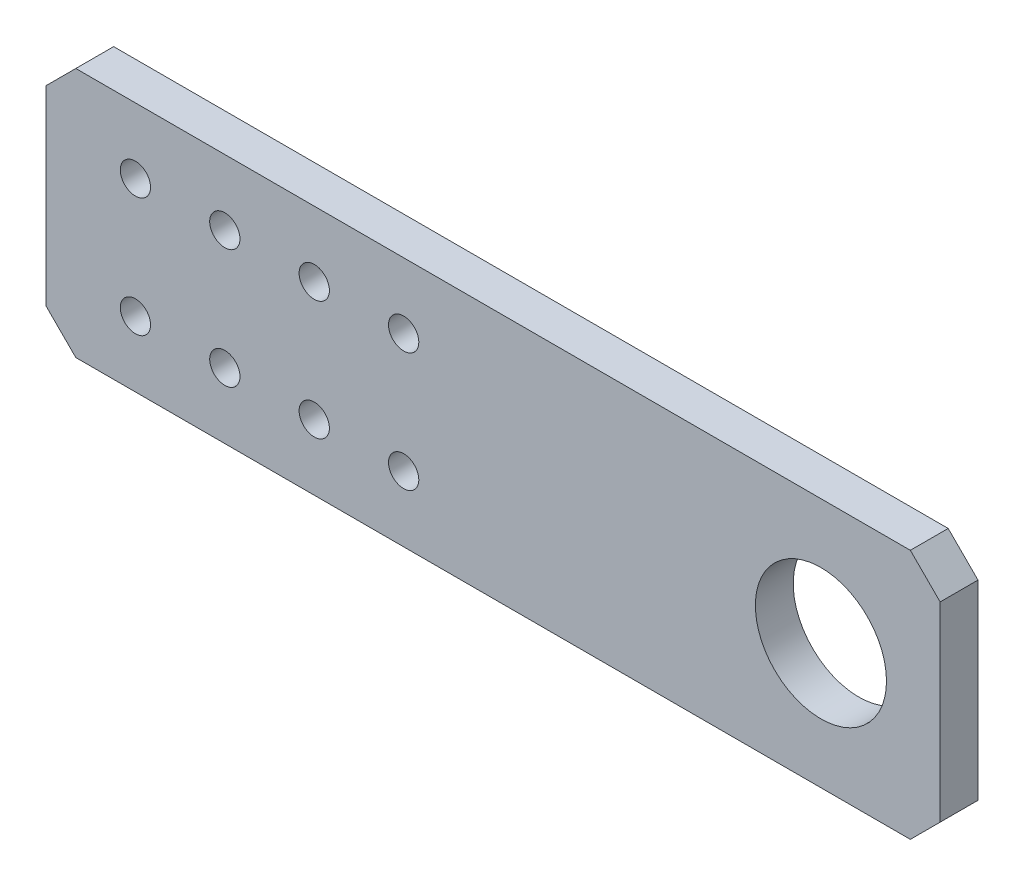
ISO-10303-21;
HEADER;
FILE_DESCRIPTION(('STEP AP214'),'2;1');
FILE_NAME('part.step','',(''),(''),'','','');
FILE_SCHEMA(('AUTOMOTIVE_DESIGN { 1 0 10303 214 1 1 1 1 }'));
ENDSEC;
DATA;
#1=APPLICATION_CONTEXT('core data for automotive mechanical design processes');
#2=APPLICATION_PROTOCOL_DEFINITION('international standard','automotive_design',2000,#1);
#3=PRODUCT_CONTEXT('',#1,'mechanical');
#4=PRODUCT('Part','Part','',(#3));
#5=PRODUCT_RELATED_PRODUCT_CATEGORY('part','',(#4));
#6=PRODUCT_DEFINITION_FORMATION('','',#4);
#7=PRODUCT_DEFINITION_CONTEXT('part definition',#1,'design');
#8=PRODUCT_DEFINITION('design','',#6,#7);
#9=PRODUCT_DEFINITION_SHAPE('','',#8);
#10=(LENGTH_UNIT() NAMED_UNIT(*) SI_UNIT(.MILLI.,.METRE.));
#11=(NAMED_UNIT(*) PLANE_ANGLE_UNIT() SI_UNIT($,.RADIAN.));
#12=(NAMED_UNIT(*) SI_UNIT($,.STERADIAN.) SOLID_ANGLE_UNIT());
#13=UNCERTAINTY_MEASURE_WITH_UNIT(LENGTH_MEASURE(1.E-05),#10,'distance_accuracy_value','');
#14=(GEOMETRIC_REPRESENTATION_CONTEXT(3) GLOBAL_UNCERTAINTY_ASSIGNED_CONTEXT((#13)) GLOBAL_UNIT_ASSIGNED_CONTEXT((#10,
#11,#12)) REPRESENTATION_CONTEXT('',''));
#15=CARTESIAN_POINT('',(0.,0.,0.));
#16=DIRECTION('',(0.,0.,1.));
#17=DIRECTION('',(1.,0.,0.));
#18=AXIS2_PLACEMENT_3D('',#15,#16,#17);
#19=CARTESIAN_POINT('',(-100.,21.,6.35));
#20=DIRECTION('',(0.,-1.,0.));
#21=DIRECTION('',(0.,0.,-1.));
#22=AXIS2_PLACEMENT_3D('',#19,#20,#21);
#23=PLANE('',#22);
#24=DIRECTION('',(0.,0.,1.));
#25=VECTOR('',#24,1.);
#26=CARTESIAN_POINT('',(-45.,21.,-3.65));
#27=LINE('',#26,#25);
#28=CARTESIAN_POINT('',(-45.,21.,0.));
#29=VERTEX_POINT('',#28);
#30=CARTESIAN_POINT('',(-45.,21.,6.35));
#31=VERTEX_POINT('',#30);
#32=EDGE_CURVE('E121',#29,#31,#27,.T.);
#33=ORIENTED_EDGE('',*,*,#32,.T.);
#34=DIRECTION('',(-1.,0.,0.));
#35=VECTOR('',#34,1.);
#36=CARTESIAN_POINT('',(-100.,21.,6.35));
#37=LINE('',#36,#35);
#38=CARTESIAN_POINT('',(95.,21.,6.35));
#39=VERTEX_POINT('',#38);
#40=EDGE_CURVE('E159',#39,#31,#37,.T.);
#41=ORIENTED_EDGE('',*,*,#40,.F.);
#42=DIRECTION('',(0.,0.,-1.));
#43=VECTOR('',#42,1.);
#44=CARTESIAN_POINT('',(95.,21.,6.35));
#45=LINE('',#44,#43);
#46=CARTESIAN_POINT('',(95.,21.,0.));
#47=VERTEX_POINT('',#46);
#48=EDGE_CURVE('E174',#39,#47,#45,.T.);
#49=ORIENTED_EDGE('',*,*,#48,.T.);
#50=DIRECTION('',(-1.,0.,0.));
#51=VECTOR('',#50,1.);
#52=CARTESIAN_POINT('',(-100.,21.,0.));
#53=LINE('',#52,#51);
#54=EDGE_CURVE('E166',#47,#29,#53,.T.);
#55=ORIENTED_EDGE('',*,*,#54,.T.);
#56=EDGE_LOOP('',(#33,#41,#49,#55));
#57=FACE_BOUND('',#56,.T.);
#58=ADVANCED_FACE('F33',(#57),#23,.F.);
#59=CARTESIAN_POINT('',(-100.,-21.,6.35));
#60=DIRECTION('',(0.,1.,0.));
#61=DIRECTION('',(0.,0.,1.));
#62=AXIS2_PLACEMENT_3D('',#59,#60,#61);
#63=PLANE('',#62);
#64=DIRECTION('',(0.,0.,1.));
#65=VECTOR('',#64,1.);
#66=CARTESIAN_POINT('',(-45.,-21.,-3.65));
#67=LINE('',#66,#65);
#68=CARTESIAN_POINT('',(-45.,-21.,0.));
#69=VERTEX_POINT('',#68);
#70=CARTESIAN_POINT('',(-45.,-21.,6.35));
#71=VERTEX_POINT('',#70);
#72=EDGE_CURVE('E111',#69,#71,#67,.T.);
#73=ORIENTED_EDGE('',*,*,#72,.F.);
#74=DIRECTION('',(1.,0.,0.));
#75=VECTOR('',#74,1.);
#76=CARTESIAN_POINT('',(-100.,-21.,0.));
#77=LINE('',#76,#75);
#78=CARTESIAN_POINT('',(95.,-21.,0.));
#79=VERTEX_POINT('',#78);
#80=EDGE_CURVE('E160',#69,#79,#77,.T.);
#81=ORIENTED_EDGE('',*,*,#80,.T.);
#82=DIRECTION('',(0.,0.,1.));
#83=VECTOR('',#82,1.);
#84=CARTESIAN_POINT('',(95.,-21.,6.35));
#85=LINE('',#84,#83);
#86=CARTESIAN_POINT('',(95.,-21.,6.35));
#87=VERTEX_POINT('',#86);
#88=EDGE_CURVE('E181',#79,#87,#85,.T.);
#89=ORIENTED_EDGE('',*,*,#88,.T.);
#90=DIRECTION('',(1.,0.,0.));
#91=VECTOR('',#90,1.);
#92=CARTESIAN_POINT('',(-100.,-21.,6.35));
#93=LINE('',#92,#91);
#94=EDGE_CURVE('E56',#71,#87,#93,.T.);
#95=ORIENTED_EDGE('',*,*,#94,.F.);
#96=EDGE_LOOP('',(#73,#81,#89,#95));
#97=FACE_BOUND('',#96,.T.);
#98=ADVANCED_FACE('F218',(#97),#63,.F.);
#99=CARTESIAN_POINT('',(0.,0.,6.35));
#100=DIRECTION('',(0.,0.,1.));
#101=DIRECTION('',(1.,0.,0.));
#102=AXIS2_PLACEMENT_3D('',#99,#100,#101);
#103=PLANE('',#102);
#104=CARTESIAN_POINT('',(80.,0.,6.35));
#105=DIRECTION('',(0.,0.,1.));
#106=DIRECTION('',(1.,0.,0.));
#107=AXIS2_PLACEMENT_3D('',#104,#105,#106);
#108=CIRCLE('',#107,11.);
#109=CARTESIAN_POINT('',(91.,0.,6.35));
#110=VERTEX_POINT('',#109);
#111=EDGE_CURVE('E152',#110,#110,#108,.T.);
#112=ORIENTED_EDGE('',*,*,#111,.F.);
#113=EDGE_LOOP('',(#112));
#114=FACE_BOUND('',#113,.T.);
#115=CARTESIAN_POINT('',(10.0000000000002,-10.,6.35));
#116=DIRECTION('',(0.,0.,1.));
#117=DIRECTION('',(1.,0.,0.));
#118=AXIS2_PLACEMENT_3D('',#115,#116,#117);
#119=CIRCLE('',#118,2.54);
#120=CARTESIAN_POINT('',(12.5400000000002,-10.,6.35));
#121=VERTEX_POINT('',#120);
#122=EDGE_CURVE('E145',#121,#121,#119,.T.);
#123=ORIENTED_EDGE('',*,*,#122,.F.);
#124=EDGE_LOOP('',(#123));
#125=FACE_BOUND('',#124,.T.);
#126=CARTESIAN_POINT('',(10.,10.,6.35));
#127=DIRECTION('',(0.,0.,1.));
#128=DIRECTION('',(1.,0.,0.));
#129=AXIS2_PLACEMENT_3D('',#126,#127,#128);
#130=CIRCLE('',#129,2.54);
#131=CARTESIAN_POINT('',(12.54,10.,6.35));
#132=VERTEX_POINT('',#131);
#133=EDGE_CURVE('E142',#132,#132,#130,.T.);
#134=ORIENTED_EDGE('',*,*,#133,.F.);
#135=EDGE_LOOP('',(#134));
#136=FACE_BOUND('',#135,.T.);
#137=CARTESIAN_POINT('',(-4.99999999999979,-10.,6.35));
#138=DIRECTION('',(0.,0.,1.));
#139=DIRECTION('',(1.,0.,0.));
#140=AXIS2_PLACEMENT_3D('',#137,#138,#139);
#141=CIRCLE('',#140,2.54);
#142=CARTESIAN_POINT('',(-2.45999999999979,-10.,6.35));
#143=VERTEX_POINT('',#142);
#144=EDGE_CURVE('E139',#143,#143,#141,.T.);
#145=ORIENTED_EDGE('',*,*,#144,.F.);
#146=EDGE_LOOP('',(#145));
#147=FACE_BOUND('',#146,.T.);
#148=CARTESIAN_POINT('',(-5.,10.,6.35));
#149=DIRECTION('',(0.,0.,1.));
#150=DIRECTION('',(1.,0.,0.));
#151=AXIS2_PLACEMENT_3D('',#148,#149,#150);
#152=CIRCLE('',#151,2.54);
#153=CARTESIAN_POINT('',(-2.46,10.,6.35));
#154=VERTEX_POINT('',#153);
#155=EDGE_CURVE('E136',#154,#154,#152,.T.);
#156=ORIENTED_EDGE('',*,*,#155,.F.);
#157=EDGE_LOOP('',(#156));
#158=FACE_BOUND('',#157,.T.);
#159=CARTESIAN_POINT('',(-19.9999999999998,-10.,6.35));
#160=DIRECTION('',(0.,0.,1.));
#161=DIRECTION('',(1.,0.,0.));
#162=AXIS2_PLACEMENT_3D('',#159,#160,#161);
#163=CIRCLE('',#162,2.54);
#164=CARTESIAN_POINT('',(-17.4599999999998,-10.,6.35));
#165=VERTEX_POINT('',#164);
#166=EDGE_CURVE('E133',#165,#165,#163,.T.);
#167=ORIENTED_EDGE('',*,*,#166,.F.);
#168=EDGE_LOOP('',(#167));
#169=FACE_BOUND('',#168,.T.);
#170=CARTESIAN_POINT('',(-20.,10.,6.35));
#171=DIRECTION('',(0.,0.,1.));
#172=DIRECTION('',(1.,0.,0.));
#173=AXIS2_PLACEMENT_3D('',#170,#171,#172);
#174=CIRCLE('',#173,2.54);
#175=CARTESIAN_POINT('',(-17.46,10.,6.35));
#176=VERTEX_POINT('',#175);
#177=EDGE_CURVE('E130',#176,#176,#174,.T.);
#178=ORIENTED_EDGE('',*,*,#177,.F.);
#179=EDGE_LOOP('',(#178));
#180=FACE_BOUND('',#179,.T.);
#181=CARTESIAN_POINT('',(-34.9999999999998,-10.,6.35));
#182=DIRECTION('',(0.,0.,1.));
#183=DIRECTION('',(1.,0.,0.));
#184=AXIS2_PLACEMENT_3D('',#181,#182,#183);
#185=CIRCLE('',#184,2.54);
#186=CARTESIAN_POINT('',(-32.4599999999998,-10.,6.35));
#187=VERTEX_POINT('',#186);
#188=EDGE_CURVE('E127',#187,#187,#185,.T.);
#189=ORIENTED_EDGE('',*,*,#188,.F.);
#190=EDGE_LOOP('',(#189));
#191=FACE_BOUND('',#190,.T.);
#192=CARTESIAN_POINT('',(-35.,10.,6.35));
#193=DIRECTION('',(0.,0.,1.));
#194=DIRECTION('',(1.,0.,0.));
#195=AXIS2_PLACEMENT_3D('',#192,#193,#194);
#196=CIRCLE('',#195,2.54);
#197=CARTESIAN_POINT('',(-32.46,10.,6.35));
#198=VERTEX_POINT('',#197);
#199=EDGE_CURVE('E112',#198,#198,#196,.T.);
#200=ORIENTED_EDGE('',*,*,#199,.F.);
#201=EDGE_LOOP('',(#200));
#202=FACE_BOUND('',#201,.T.);
#203=DIRECTION('',(0.,-1.,0.));
#204=VECTOR('',#203,1.);
#205=CARTESIAN_POINT('',(-50.,0.,6.35));
#206=LINE('',#205,#204);
#207=CARTESIAN_POINT('',(-50.,16.,6.35));
#208=VERTEX_POINT('',#207);
#209=CARTESIAN_POINT('',(-50.,-16.,6.35));
#210=VERTEX_POINT('',#209);
#211=EDGE_CURVE('E100',#208,#210,#206,.T.);
#212=ORIENTED_EDGE('',*,*,#211,.T.);
#213=DIRECTION('',(0.707106781186547,-0.707106781186548,0.));
#214=VECTOR('',#213,1.);
#215=CARTESIAN_POINT('',(-33.,-33.,6.35));
#216=LINE('',#215,#214);
#217=EDGE_CURVE('E108',#210,#71,#216,.T.);
#218=ORIENTED_EDGE('',*,*,#217,.T.);
#219=ORIENTED_EDGE('',*,*,#94,.T.);
#220=DIRECTION('',(-0.707106781186549,-0.707106781186546,0.));
#221=VECTOR('',#220,1.);
#222=CARTESIAN_POINT('',(57.9999999999997,-58.,6.35));
#223=LINE('',#222,#221);
#224=CARTESIAN_POINT('',(100.,-16.,6.35));
#225=VERTEX_POINT('',#224);
#226=EDGE_CURVE('E177',#87,#225,#223,.F.);
#227=ORIENTED_EDGE('',*,*,#226,.T.);
#228=DIRECTION('',(0.,1.,0.));
#229=VECTOR('',#228,1.);
#230=CARTESIAN_POINT('',(100.,21.,6.35));
#231=LINE('',#230,#229);
#232=CARTESIAN_POINT('',(100.,16.,6.35));
#233=VERTEX_POINT('',#232);
#234=EDGE_CURVE('E156',#225,#233,#231,.T.);
#235=ORIENTED_EDGE('',*,*,#234,.T.);
#236=DIRECTION('',(0.707106781186546,-0.707106781186549,0.));
#237=VECTOR('',#236,1.);
#238=CARTESIAN_POINT('',(58.0000000000003,58.,6.35));
#239=LINE('',#238,#237);
#240=EDGE_CURVE('E179',#233,#39,#239,.F.);
#241=ORIENTED_EDGE('',*,*,#240,.T.);
#242=ORIENTED_EDGE('',*,*,#40,.T.);
#243=DIRECTION('',(-0.707106781186547,-0.707106781186548,0.));
#244=VECTOR('',#243,1.);
#245=CARTESIAN_POINT('',(-33.,33.,6.35));
#246=LINE('',#245,#244);
#247=EDGE_CURVE('E106',#31,#208,#246,.T.);
#248=ORIENTED_EDGE('',*,*,#247,.T.);
#249=EDGE_LOOP('',(#212,#218,#219,#227,#235,#241,#242,#248));
#250=FACE_BOUND('',#249,.T.);
#251=ADVANCED_FACE('F114',(#114,#125,#136,#147,#158,#169,#180,#191,#202,#250),#103,.T.);
#252=CARTESIAN_POINT('',(0.,0.,0.));
#253=DIRECTION('',(0.,0.,1.));
#254=DIRECTION('',(1.,0.,0.));
#255=AXIS2_PLACEMENT_3D('',#252,#253,#254);
#256=PLANE('',#255);
#257=CARTESIAN_POINT('',(80.,0.,0.));
#258=DIRECTION('',(0.,0.,1.));
#259=DIRECTION('',(1.,0.,0.));
#260=AXIS2_PLACEMENT_3D('',#257,#258,#259);
#261=CIRCLE('',#260,11.);
#262=CARTESIAN_POINT('',(91.,0.,0.));
#263=VERTEX_POINT('',#262);
#264=EDGE_CURVE('E148',#263,#263,#261,.T.);
#265=ORIENTED_EDGE('',*,*,#264,.T.);
#266=EDGE_LOOP('',(#265));
#267=FACE_BOUND('',#266,.T.);
#268=CARTESIAN_POINT('',(10.0000000000002,-10.,0.));
#269=DIRECTION('',(0.,0.,1.));
#270=DIRECTION('',(1.,0.,0.));
#271=AXIS2_PLACEMENT_3D('',#268,#269,#270);
#272=CIRCLE('',#271,2.54);
#273=CARTESIAN_POINT('',(12.5400000000002,-10.,0.));
#274=VERTEX_POINT('',#273);
#275=EDGE_CURVE('E120',#274,#274,#272,.T.);
#276=ORIENTED_EDGE('',*,*,#275,.T.);
#277=EDGE_LOOP('',(#276));
#278=FACE_BOUND('',#277,.T.);
#279=CARTESIAN_POINT('',(10.,10.,0.));
#280=DIRECTION('',(0.,0.,1.));
#281=DIRECTION('',(1.,0.,0.));
#282=AXIS2_PLACEMENT_3D('',#279,#280,#281);
#283=CIRCLE('',#282,2.54);
#284=CARTESIAN_POINT('',(12.54,10.,0.));
#285=VERTEX_POINT('',#284);
#286=EDGE_CURVE('E190',#285,#285,#283,.T.);
#287=ORIENTED_EDGE('',*,*,#286,.T.);
#288=EDGE_LOOP('',(#287));
#289=FACE_BOUND('',#288,.T.);
#290=CARTESIAN_POINT('',(-4.99999999999979,-10.,0.));
#291=DIRECTION('',(0.,0.,1.));
#292=DIRECTION('',(1.,0.,0.));
#293=AXIS2_PLACEMENT_3D('',#290,#291,#292);
#294=CIRCLE('',#293,2.54);
#295=CARTESIAN_POINT('',(-2.45999999999979,-10.,0.));
#296=VERTEX_POINT('',#295);
#297=EDGE_CURVE('E193',#296,#296,#294,.T.);
#298=ORIENTED_EDGE('',*,*,#297,.T.);
#299=EDGE_LOOP('',(#298));
#300=FACE_BOUND('',#299,.T.);
#301=CARTESIAN_POINT('',(-5.,10.,0.));
#302=DIRECTION('',(0.,0.,1.));
#303=DIRECTION('',(1.,0.,0.));
#304=AXIS2_PLACEMENT_3D('',#301,#302,#303);
#305=CIRCLE('',#304,2.54);
#306=CARTESIAN_POINT('',(-2.46,10.,0.));
#307=VERTEX_POINT('',#306);
#308=EDGE_CURVE('E196',#307,#307,#305,.T.);
#309=ORIENTED_EDGE('',*,*,#308,.T.);
#310=EDGE_LOOP('',(#309));
#311=FACE_BOUND('',#310,.T.);
#312=CARTESIAN_POINT('',(-19.9999999999998,-10.,0.));
#313=DIRECTION('',(0.,0.,1.));
#314=DIRECTION('',(1.,0.,0.));
#315=AXIS2_PLACEMENT_3D('',#312,#313,#314);
#316=CIRCLE('',#315,2.54);
#317=CARTESIAN_POINT('',(-17.4599999999998,-10.,0.));
#318=VERTEX_POINT('',#317);
#319=EDGE_CURVE('E199',#318,#318,#316,.T.);
#320=ORIENTED_EDGE('',*,*,#319,.T.);
#321=EDGE_LOOP('',(#320));
#322=FACE_BOUND('',#321,.T.);
#323=CARTESIAN_POINT('',(-20.,10.,0.));
#324=DIRECTION('',(0.,0.,1.));
#325=DIRECTION('',(1.,0.,0.));
#326=AXIS2_PLACEMENT_3D('',#323,#324,#325);
#327=CIRCLE('',#326,2.54);
#328=CARTESIAN_POINT('',(-17.46,10.,0.));
#329=VERTEX_POINT('',#328);
#330=EDGE_CURVE('E202',#329,#329,#327,.T.);
#331=ORIENTED_EDGE('',*,*,#330,.T.);
#332=EDGE_LOOP('',(#331));
#333=FACE_BOUND('',#332,.T.);
#334=CARTESIAN_POINT('',(-34.9999999999998,-10.,0.));
#335=DIRECTION('',(0.,0.,1.));
#336=DIRECTION('',(1.,0.,0.));
#337=AXIS2_PLACEMENT_3D('',#334,#335,#336);
#338=CIRCLE('',#337,2.54);
#339=CARTESIAN_POINT('',(-32.4599999999998,-10.,0.));
#340=VERTEX_POINT('',#339);
#341=EDGE_CURVE('E205',#340,#340,#338,.T.);
#342=ORIENTED_EDGE('',*,*,#341,.T.);
#343=EDGE_LOOP('',(#342));
#344=FACE_BOUND('',#343,.T.);
#345=CARTESIAN_POINT('',(-35.,10.,0.));
#346=DIRECTION('',(0.,0.,1.));
#347=DIRECTION('',(1.,0.,0.));
#348=AXIS2_PLACEMENT_3D('',#345,#346,#347);
#349=CIRCLE('',#348,2.54);
#350=CARTESIAN_POINT('',(-32.46,10.,0.));
#351=VERTEX_POINT('',#350);
#352=EDGE_CURVE('E155',#351,#351,#349,.T.);
#353=ORIENTED_EDGE('',*,*,#352,.T.);
#354=EDGE_LOOP('',(#353));
#355=FACE_BOUND('',#354,.T.);
#356=DIRECTION('',(0.707106781186547,-0.707106781186548,0.));
#357=VECTOR('',#356,1.);
#358=CARTESIAN_POINT('',(-33.,-33.,0.));
#359=LINE('',#358,#357);
#360=CARTESIAN_POINT('',(-50.,-16.,0.));
#361=VERTEX_POINT('',#360);
#362=EDGE_CURVE('E11',#361,#69,#359,.T.);
#363=ORIENTED_EDGE('',*,*,#362,.F.);
#364=DIRECTION('',(0.,-1.,0.));
#365=VECTOR('',#364,1.);
#366=CARTESIAN_POINT('',(-50.,0.,0.));
#367=LINE('',#366,#365);
#368=CARTESIAN_POINT('',(-50.,16.,0.));
#369=VERTEX_POINT('',#368);
#370=EDGE_CURVE('E103',#369,#361,#367,.T.);
#371=ORIENTED_EDGE('',*,*,#370,.F.);
#372=DIRECTION('',(-0.707106781186547,-0.707106781186548,0.));
#373=VECTOR('',#372,1.);
#374=CARTESIAN_POINT('',(-33.,33.,0.));
#375=LINE('',#374,#373);
#376=EDGE_CURVE('E41',#29,#369,#375,.T.);
#377=ORIENTED_EDGE('',*,*,#376,.F.);
#378=ORIENTED_EDGE('',*,*,#54,.F.);
#379=DIRECTION('',(-0.707106781186546,0.707106781186549,0.));
#380=VECTOR('',#379,1.);
#381=CARTESIAN_POINT('',(95.,21.,0.));
#382=LINE('',#381,#380);
#383=CARTESIAN_POINT('',(100.,16.,0.));
#384=VERTEX_POINT('',#383);
#385=EDGE_CURVE('E172',#47,#384,#382,.F.);
#386=ORIENTED_EDGE('',*,*,#385,.T.);
#387=DIRECTION('',(0.,1.,0.));
#388=VECTOR('',#387,1.);
#389=CARTESIAN_POINT('',(100.,21.,0.));
#390=LINE('',#389,#388);
#391=CARTESIAN_POINT('',(100.,-16.,0.));
#392=VERTEX_POINT('',#391);
#393=EDGE_CURVE('E151',#392,#384,#390,.T.);
#394=ORIENTED_EDGE('',*,*,#393,.F.);
#395=DIRECTION('',(0.707106781186549,0.707106781186546,0.));
#396=VECTOR('',#395,1.);
#397=CARTESIAN_POINT('',(100.,-16.,0.));
#398=LINE('',#397,#396);
#399=EDGE_CURVE('E163',#392,#79,#398,.F.);
#400=ORIENTED_EDGE('',*,*,#399,.T.);
#401=ORIENTED_EDGE('',*,*,#80,.F.);
#402=EDGE_LOOP('',(#363,#371,#377,#378,#386,#394,#400,#401));
#403=FACE_BOUND('',#402,.T.);
#404=ADVANCED_FACE('F215',(#267,#278,#289,#300,#311,#322,#333,#344,#355,#403),#256,.F.);
#405=CARTESIAN_POINT('',(100.,21.,6.35));
#406=DIRECTION('',(-1.,0.,0.));
#407=DIRECTION('',(0.,0.,1.));
#408=AXIS2_PLACEMENT_3D('',#405,#406,#407);
#409=PLANE('',#408);
#410=ORIENTED_EDGE('',*,*,#393,.T.);
#411=DIRECTION('',(0.,0.,1.));
#412=VECTOR('',#411,1.);
#413=CARTESIAN_POINT('',(100.,16.,6.35));
#414=LINE('',#413,#412);
#415=EDGE_CURVE('E186',#384,#233,#414,.T.);
#416=ORIENTED_EDGE('',*,*,#415,.T.);
#417=ORIENTED_EDGE('',*,*,#234,.F.);
#418=DIRECTION('',(0.,0.,-1.));
#419=VECTOR('',#418,1.);
#420=CARTESIAN_POINT('',(100.,-16.,6.35));
#421=LINE('',#420,#419);
#422=EDGE_CURVE('E183',#225,#392,#421,.T.);
#423=ORIENTED_EDGE('',*,*,#422,.T.);
#424=EDGE_LOOP('',(#410,#416,#417,#423));
#425=FACE_BOUND('',#424,.T.);
#426=ADVANCED_FACE('F226',(#425),#409,.F.);
#427=CARTESIAN_POINT('',(95.,21.,6.35));
#428=DIRECTION('',(-0.707106781186549,-0.707106781186545,0.));
#429=DIRECTION('',(0.,0.,-1.));
#430=AXIS2_PLACEMENT_3D('',#427,#428,#429);
#431=PLANE('',#430);
#432=ORIENTED_EDGE('',*,*,#240,.F.);
#433=ORIENTED_EDGE('',*,*,#415,.F.);
#434=ORIENTED_EDGE('',*,*,#385,.F.);
#435=ORIENTED_EDGE('',*,*,#48,.F.);
#436=EDGE_LOOP('',(#432,#433,#434,#435));
#437=FACE_BOUND('',#436,.T.);
#438=ADVANCED_FACE('F230',(#437),#431,.F.);
#439=CARTESIAN_POINT('',(100.,-16.,6.35));
#440=DIRECTION('',(-0.707106781186546,0.707106781186549,0.));
#441=DIRECTION('',(0.,0.,-1.));
#442=AXIS2_PLACEMENT_3D('',#439,#440,#441);
#443=PLANE('',#442);
#444=ORIENTED_EDGE('',*,*,#226,.F.);
#445=ORIENTED_EDGE('',*,*,#88,.F.);
#446=ORIENTED_EDGE('',*,*,#399,.F.);
#447=ORIENTED_EDGE('',*,*,#422,.F.);
#448=EDGE_LOOP('',(#444,#445,#446,#447));
#449=FACE_BOUND('',#448,.T.);
#450=ADVANCED_FACE('F35',(#449),#443,.F.);
#451=CARTESIAN_POINT('',(80.,0.,0.));
#452=DIRECTION('',(0.,0.,1.));
#453=DIRECTION('',(1.,0.,0.));
#454=AXIS2_PLACEMENT_3D('',#451,#452,#453);
#455=CYLINDRICAL_SURFACE('',#454,11.);
#456=ORIENTED_EDGE('',*,*,#264,.F.);
#457=EDGE_LOOP('',(#456));
#458=FACE_BOUND('',#457,.T.);
#459=ORIENTED_EDGE('',*,*,#111,.T.);
#460=EDGE_LOOP('',(#459));
#461=FACE_BOUND('',#460,.T.);
#462=ADVANCED_FACE('F247',(#458,#461),#455,.F.);
#463=CARTESIAN_POINT('',(10.0000000000002,-10.,-3.65));
#464=DIRECTION('',(0.,0.,1.));
#465=DIRECTION('',(1.,0.,0.));
#466=AXIS2_PLACEMENT_3D('',#463,#464,#465);
#467=CYLINDRICAL_SURFACE('',#466,2.54);
#468=ORIENTED_EDGE('',*,*,#122,.T.);
#469=EDGE_LOOP('',(#468));
#470=FACE_BOUND('',#469,.T.);
#471=ORIENTED_EDGE('',*,*,#275,.F.);
#472=EDGE_LOOP('',(#471));
#473=FACE_BOUND('',#472,.T.);
#474=ADVANCED_FACE('F251',(#470,#473),#467,.F.);
#475=CARTESIAN_POINT('',(10.,10.,-3.65));
#476=DIRECTION('',(0.,0.,1.));
#477=DIRECTION('',(1.,0.,0.));
#478=AXIS2_PLACEMENT_3D('',#475,#476,#477);
#479=CYLINDRICAL_SURFACE('',#478,2.54);
#480=ORIENTED_EDGE('',*,*,#133,.T.);
#481=EDGE_LOOP('',(#480));
#482=FACE_BOUND('',#481,.T.);
#483=ORIENTED_EDGE('',*,*,#286,.F.);
#484=EDGE_LOOP('',(#483));
#485=FACE_BOUND('',#484,.T.);
#486=ADVANCED_FACE('F257',(#482,#485),#479,.F.);
#487=CARTESIAN_POINT('',(-4.99999999999979,-10.,-3.65));
#488=DIRECTION('',(0.,0.,1.));
#489=DIRECTION('',(1.,0.,0.));
#490=AXIS2_PLACEMENT_3D('',#487,#488,#489);
#491=CYLINDRICAL_SURFACE('',#490,2.54);
#492=ORIENTED_EDGE('',*,*,#144,.T.);
#493=EDGE_LOOP('',(#492));
#494=FACE_BOUND('',#493,.T.);
#495=ORIENTED_EDGE('',*,*,#297,.F.);
#496=EDGE_LOOP('',(#495));
#497=FACE_BOUND('',#496,.T.);
#498=ADVANCED_FACE('F312',(#494,#497),#491,.F.);
#499=CARTESIAN_POINT('',(-5.,10.,-3.65));
#500=DIRECTION('',(0.,0.,1.));
#501=DIRECTION('',(1.,0.,0.));
#502=AXIS2_PLACEMENT_3D('',#499,#500,#501);
#503=CYLINDRICAL_SURFACE('',#502,2.54);
#504=ORIENTED_EDGE('',*,*,#155,.T.);
#505=EDGE_LOOP('',(#504));
#506=FACE_BOUND('',#505,.T.);
#507=ORIENTED_EDGE('',*,*,#308,.F.);
#508=EDGE_LOOP('',(#507));
#509=FACE_BOUND('',#508,.T.);
#510=ADVANCED_FACE('F308',(#506,#509),#503,.F.);
#511=CARTESIAN_POINT('',(-19.9999999999998,-10.,-3.65));
#512=DIRECTION('',(0.,0.,1.));
#513=DIRECTION('',(1.,0.,0.));
#514=AXIS2_PLACEMENT_3D('',#511,#512,#513);
#515=CYLINDRICAL_SURFACE('',#514,2.54);
#516=ORIENTED_EDGE('',*,*,#166,.T.);
#517=EDGE_LOOP('',(#516));
#518=FACE_BOUND('',#517,.T.);
#519=ORIENTED_EDGE('',*,*,#319,.F.);
#520=EDGE_LOOP('',(#519));
#521=FACE_BOUND('',#520,.T.);
#522=ADVANCED_FACE('F304',(#518,#521),#515,.F.);
#523=CARTESIAN_POINT('',(-20.,10.,-3.65));
#524=DIRECTION('',(0.,0.,1.));
#525=DIRECTION('',(1.,0.,0.));
#526=AXIS2_PLACEMENT_3D('',#523,#524,#525);
#527=CYLINDRICAL_SURFACE('',#526,2.54);
#528=ORIENTED_EDGE('',*,*,#177,.T.);
#529=EDGE_LOOP('',(#528));
#530=FACE_BOUND('',#529,.T.);
#531=ORIENTED_EDGE('',*,*,#330,.F.);
#532=EDGE_LOOP('',(#531));
#533=FACE_BOUND('',#532,.T.);
#534=ADVANCED_FACE('F297',(#530,#533),#527,.F.);
#535=CARTESIAN_POINT('',(-34.9999999999998,-10.,-3.65));
#536=DIRECTION('',(0.,0.,1.));
#537=DIRECTION('',(1.,0.,0.));
#538=AXIS2_PLACEMENT_3D('',#535,#536,#537);
#539=CYLINDRICAL_SURFACE('',#538,2.54);
#540=ORIENTED_EDGE('',*,*,#188,.T.);
#541=EDGE_LOOP('',(#540));
#542=FACE_BOUND('',#541,.T.);
#543=ORIENTED_EDGE('',*,*,#341,.F.);
#544=EDGE_LOOP('',(#543));
#545=FACE_BOUND('',#544,.T.);
#546=ADVANCED_FACE('F289',(#542,#545),#539,.F.);
#547=CARTESIAN_POINT('',(-35.,10.,-3.65));
#548=DIRECTION('',(0.,0.,1.));
#549=DIRECTION('',(1.,0.,0.));
#550=AXIS2_PLACEMENT_3D('',#547,#548,#549);
#551=CYLINDRICAL_SURFACE('',#550,2.54);
#552=ORIENTED_EDGE('',*,*,#199,.T.);
#553=EDGE_LOOP('',(#552));
#554=FACE_BOUND('',#553,.T.);
#555=ORIENTED_EDGE('',*,*,#352,.F.);
#556=EDGE_LOOP('',(#555));
#557=FACE_BOUND('',#556,.T.);
#558=ADVANCED_FACE('F287',(#554,#557),#551,.F.);
#559=CARTESIAN_POINT('',(-33.,-33.,-3.65));
#560=DIRECTION('',(-0.707106781186548,-0.707106781186547,0.));
#561=DIRECTION('',(0.707106781186547,-0.707106781186548,0.));
#562=AXIS2_PLACEMENT_3D('',#559,#560,#561);
#563=PLANE('',#562);
#564=ORIENTED_EDGE('',*,*,#362,.T.);
#565=ORIENTED_EDGE('',*,*,#72,.T.);
#566=ORIENTED_EDGE('',*,*,#217,.F.);
#567=DIRECTION('',(0.,0.,1.));
#568=VECTOR('',#567,1.);
#569=CARTESIAN_POINT('',(-50.,-16.,-3.65));
#570=LINE('',#569,#568);
#571=EDGE_CURVE('E96',#361,#210,#570,.T.);
#572=ORIENTED_EDGE('',*,*,#571,.F.);
#573=EDGE_LOOP('',(#564,#565,#566,#572));
#574=FACE_BOUND('',#573,.T.);
#575=ADVANCED_FACE('F109',(#574),#563,.T.);
#576=CARTESIAN_POINT('',(-33.,33.,-3.65));
#577=DIRECTION('',(-0.707106781186548,0.707106781186547,0.));
#578=DIRECTION('',(-0.707106781186547,-0.707106781186548,0.));
#579=AXIS2_PLACEMENT_3D('',#576,#577,#578);
#580=PLANE('',#579);
#581=ORIENTED_EDGE('',*,*,#376,.T.);
#582=DIRECTION('',(0.,0.,1.));
#583=VECTOR('',#582,1.);
#584=CARTESIAN_POINT('',(-50.,16.,-3.65));
#585=LINE('',#584,#583);
#586=EDGE_CURVE('E48',#369,#208,#585,.T.);
#587=ORIENTED_EDGE('',*,*,#586,.T.);
#588=ORIENTED_EDGE('',*,*,#247,.F.);
#589=ORIENTED_EDGE('',*,*,#32,.F.);
#590=EDGE_LOOP('',(#581,#587,#588,#589));
#591=FACE_BOUND('',#590,.T.);
#592=ADVANCED_FACE('F212',(#591),#580,.T.);
#593=CARTESIAN_POINT('',(-50.,0.,-3.65));
#594=DIRECTION('',(-1.,0.,0.));
#595=DIRECTION('',(0.,-1.,0.));
#596=AXIS2_PLACEMENT_3D('',#593,#594,#595);
#597=PLANE('',#596);
#598=ORIENTED_EDGE('',*,*,#370,.T.);
#599=ORIENTED_EDGE('',*,*,#571,.T.);
#600=ORIENTED_EDGE('',*,*,#211,.F.);
#601=ORIENTED_EDGE('',*,*,#586,.F.);
#602=EDGE_LOOP('',(#598,#599,#600,#601));
#603=FACE_BOUND('',#602,.T.);
#604=ADVANCED_FACE('F98',(#603),#597,.T.);
#605=CLOSED_SHELL('',(#58,#98,#251,#404,#426,#438,#450,#462,#474,#486,#498,#510,#522,#534,#546,
#558,#575,#592,#604));
#606=MANIFOLD_SOLID_BREP('B2',#605);
#607=ADVANCED_BREP_SHAPE_REPRESENTATION('',(#18,#606),#14);
#608=SHAPE_DEFINITION_REPRESENTATION(#9,#607);
ENDSEC;
END-ISO-10303-21;
